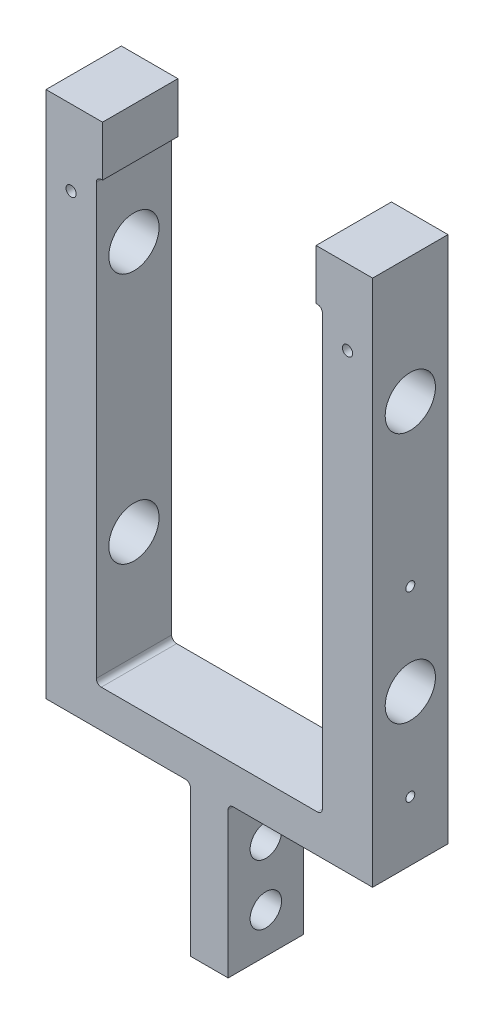
ISO-10303-21;
HEADER;
FILE_DESCRIPTION(('STEP AP214'),'2;1');
FILE_NAME('part.step','',(''),(''),'','','');
FILE_SCHEMA(('AUTOMOTIVE_DESIGN { 1 0 10303 214 1 1 1 1 }'));
ENDSEC;
DATA;
#1=APPLICATION_CONTEXT('core data for automotive mechanical design processes');
#2=APPLICATION_PROTOCOL_DEFINITION('international standard','automotive_design',2000,#1);
#3=PRODUCT_CONTEXT('',#1,'mechanical');
#4=PRODUCT('Part','Part','',(#3));
#5=PRODUCT_RELATED_PRODUCT_CATEGORY('part','',(#4));
#6=PRODUCT_DEFINITION_FORMATION('','',#4);
#7=PRODUCT_DEFINITION_CONTEXT('part definition',#1,'design');
#8=PRODUCT_DEFINITION('design','',#6,#7);
#9=PRODUCT_DEFINITION_SHAPE('','',#8);
#10=(LENGTH_UNIT() NAMED_UNIT(*) SI_UNIT(.MILLI.,.METRE.));
#11=(NAMED_UNIT(*) PLANE_ANGLE_UNIT() SI_UNIT($,.RADIAN.));
#12=(NAMED_UNIT(*) SI_UNIT($,.STERADIAN.) SOLID_ANGLE_UNIT());
#13=UNCERTAINTY_MEASURE_WITH_UNIT(LENGTH_MEASURE(1.E-05),#10,'distance_accuracy_value','');
#14=(GEOMETRIC_REPRESENTATION_CONTEXT(3) GLOBAL_UNCERTAINTY_ASSIGNED_CONTEXT((#13)) GLOBAL_UNIT_ASSIGNED_CONTEXT((#10,
#11,#12)) REPRESENTATION_CONTEXT('',''));
#15=CARTESIAN_POINT('',(0.,0.,0.));
#16=DIRECTION('',(0.,0.,1.));
#17=DIRECTION('',(1.,0.,0.));
#18=AXIS2_PLACEMENT_3D('',#15,#16,#17);
#19=CARTESIAN_POINT('',(41.275,152.4,9.52500000000001));
#20=DIRECTION('',(0.,-1.,0.));
#21=DIRECTION('',(0.,0.,-1.));
#22=AXIS2_PLACEMENT_3D('',#19,#20,#21);
#23=PLANE('',#22);
#24=DIRECTION('',(-1.,0.,0.));
#25=VECTOR('',#24,1.);
#26=CARTESIAN_POINT('',(41.275,152.4,-9.52500000000001));
#27=LINE('',#26,#25);
#28=CARTESIAN_POINT('',(41.275,152.4,-9.52500000000001));
#29=VERTEX_POINT('',#28);
#30=CARTESIAN_POINT('',(26.9875,152.4,-9.52500000000001));
#31=VERTEX_POINT('',#30);
#32=EDGE_CURVE('E272',#29,#31,#27,.T.);
#33=ORIENTED_EDGE('',*,*,#32,.T.);
#34=DIRECTION('',(0.,0.,1.));
#35=VECTOR('',#34,1.);
#36=CARTESIAN_POINT('',(26.9875,152.4,-9.52500000000001));
#37=LINE('',#36,#35);
#38=CARTESIAN_POINT('',(26.9875,152.4,9.52500000000001));
#39=VERTEX_POINT('',#38);
#40=EDGE_CURVE('E256',#31,#39,#37,.T.);
#41=ORIENTED_EDGE('',*,*,#40,.T.);
#42=DIRECTION('',(-1.,0.,0.));
#43=VECTOR('',#42,1.);
#44=CARTESIAN_POINT('',(41.275,152.4,9.52500000000001));
#45=LINE('',#44,#43);
#46=CARTESIAN_POINT('',(41.275,152.4,9.52500000000001));
#47=VERTEX_POINT('',#46);
#48=EDGE_CURVE('E464',#47,#39,#45,.T.);
#49=ORIENTED_EDGE('',*,*,#48,.F.);
#50=DIRECTION('',(0.,0.,-1.));
#51=VECTOR('',#50,1.);
#52=CARTESIAN_POINT('',(41.275,152.4,9.52500000000001));
#53=LINE('',#52,#51);
#54=EDGE_CURVE('E278',#47,#29,#53,.T.);
#55=ORIENTED_EDGE('',*,*,#54,.T.);
#56=EDGE_LOOP('',(#33,#41,#49,#55));
#57=FACE_BOUND('',#56,.T.);
#58=ADVANCED_FACE('F96',(#57),#23,.F.);
#59=CARTESIAN_POINT('',(28.575,139.7,9.52500000000001));
#60=DIRECTION('',(0.,-1.,0.));
#61=DIRECTION('',(0.,0.,-1.));
#62=AXIS2_PLACEMENT_3D('',#59,#60,#61);
#63=PLANE('',#62);
#64=DIRECTION('',(0.,0.,1.));
#65=VECTOR('',#64,1.);
#66=CARTESIAN_POINT('',(26.9875,139.7,-9.52500000000001));
#67=LINE('',#66,#65);
#68=CARTESIAN_POINT('',(26.9875,139.7,-9.52500000000001));
#69=VERTEX_POINT('',#68);
#70=CARTESIAN_POINT('',(26.9875,139.7,9.52500000000001));
#71=VERTEX_POINT('',#70);
#72=EDGE_CURVE('E510',#69,#71,#67,.T.);
#73=ORIENTED_EDGE('',*,*,#72,.F.);
#74=DIRECTION('',(-1.,0.,0.));
#75=VECTOR('',#74,1.);
#76=CARTESIAN_POINT('',(28.575,139.7,-9.52500000000001));
#77=LINE('',#76,#75);
#78=CARTESIAN_POINT('',(27.305,139.7,-9.52500000000001));
#79=VERTEX_POINT('',#78);
#80=EDGE_CURVE('E274',#79,#69,#77,.T.);
#81=ORIENTED_EDGE('',*,*,#80,.F.);
#82=DIRECTION('',(0.,0.,-1.));
#83=VECTOR('',#82,1.);
#84=CARTESIAN_POINT('',(27.305,139.7,9.52500000000001));
#85=LINE('',#84,#83);
#86=CARTESIAN_POINT('',(27.305,139.7,9.52500000000001));
#87=VERTEX_POINT('',#86);
#88=EDGE_CURVE('E371',#79,#87,#85,.F.);
#89=ORIENTED_EDGE('',*,*,#88,.T.);
#90=DIRECTION('',(-1.,0.,0.));
#91=VECTOR('',#90,1.);
#92=CARTESIAN_POINT('',(28.575,139.7,9.52500000000001));
#93=LINE('',#92,#91);
#94=EDGE_CURVE('E433',#87,#71,#93,.T.);
#95=ORIENTED_EDGE('',*,*,#94,.T.);
#96=EDGE_LOOP('',(#73,#81,#89,#95));
#97=FACE_BOUND('',#96,.T.);
#98=ADVANCED_FACE('F509',(#97),#63,.T.);
#99=CARTESIAN_POINT('',(41.275,131.596658993696,9.52500000000001));
#100=DIRECTION('',(-1.,0.,0.));
#101=DIRECTION('',(0.,-1.,0.));
#102=AXIS2_PLACEMENT_3D('',#99,#100,#101);
#103=PLANE('',#102);
#104=CARTESIAN_POINT('',(41.275,80.1624,0.));
#105=DIRECTION('',(1.,0.,0.));
#106=DIRECTION('',(0.,0.,-1.));
#107=AXIS2_PLACEMENT_3D('',#104,#105,#106);
#108=CIRCLE('',#107,1.13029999999999);
#109=CARTESIAN_POINT('',(41.275,80.1624,-1.1303));
#110=VERTEX_POINT('',#109);
#111=EDGE_CURVE('E657',#110,#110,#108,.T.);
#112=ORIENTED_EDGE('',*,*,#111,.F.);
#113=EDGE_LOOP('',(#112));
#114=FACE_BOUND('',#113,.T.);
#115=CARTESIAN_POINT('',(41.275,57.15,0.));
#116=DIRECTION('',(-1.,0.,0.));
#117=DIRECTION('',(0.,-1.,0.));
#118=AXIS2_PLACEMENT_3D('',#115,#116,#117);
#119=CIRCLE('',#118,6.34999999999673);
#120=CARTESIAN_POINT('',(41.275,50.8000000000033,0.));
#121=VERTEX_POINT('',#120);
#122=EDGE_CURVE('E321',#121,#121,#119,.T.);
#123=ORIENTED_EDGE('',*,*,#122,.T.);
#124=EDGE_LOOP('',(#123));
#125=FACE_BOUND('',#124,.T.);
#126=CARTESIAN_POINT('',(41.275,120.65,0.));
#127=DIRECTION('',(-1.,0.,0.));
#128=DIRECTION('',(0.,-1.,0.));
#129=AXIS2_PLACEMENT_3D('',#126,#127,#128);
#130=CIRCLE('',#129,6.34999999999999);
#131=CARTESIAN_POINT('',(41.275,114.3,0.));
#132=VERTEX_POINT('',#131);
#133=EDGE_CURVE('E608',#132,#132,#130,.T.);
#134=ORIENTED_EDGE('',*,*,#133,.T.);
#135=EDGE_LOOP('',(#134));
#136=FACE_BOUND('',#135,.T.);
#137=DIRECTION('',(0.,1.,0.));
#138=VECTOR('',#137,1.);
#139=CARTESIAN_POINT('',(41.275,131.596658993696,-9.52500000000001));
#140=LINE('',#139,#138);
#141=CARTESIAN_POINT('',(41.275,19.05,-9.52500000000001));
#142=VERTEX_POINT('',#141);
#143=EDGE_CURVE('E289',#142,#29,#140,.T.);
#144=ORIENTED_EDGE('',*,*,#143,.T.);
#145=ORIENTED_EDGE('',*,*,#54,.F.);
#146=DIRECTION('',(0.,1.,0.));
#147=VECTOR('',#146,1.);
#148=CARTESIAN_POINT('',(41.275,19.05,9.52500000000001));
#149=LINE('',#148,#147);
#150=CARTESIAN_POINT('',(41.275,19.05,9.52500000000001));
#151=VERTEX_POINT('',#150);
#152=EDGE_CURVE('E460',#151,#47,#149,.T.);
#153=ORIENTED_EDGE('',*,*,#152,.F.);
#154=DIRECTION('',(0.,0.,-1.));
#155=VECTOR('',#154,1.);
#156=CARTESIAN_POINT('',(41.275,19.05,9.52500000000001));
#157=LINE('',#156,#155);
#158=EDGE_CURVE('E311',#151,#142,#157,.T.);
#159=ORIENTED_EDGE('',*,*,#158,.T.);
#160=EDGE_LOOP('',(#144,#145,#153,#159));
#161=FACE_BOUND('',#160,.T.);
#162=CARTESIAN_POINT('',(41.275,34.1376,0.));
#163=DIRECTION('',(1.,0.,0.));
#164=DIRECTION('',(0.,0.,-1.));
#165=AXIS2_PLACEMENT_3D('',#162,#163,#164);
#166=CIRCLE('',#165,1.13029999999999);
#167=CARTESIAN_POINT('',(41.275,34.1376,-1.13029999999999));
#168=VERTEX_POINT('',#167);
#169=EDGE_CURVE('E649',#168,#168,#166,.T.);
#170=ORIENTED_EDGE('',*,*,#169,.F.);
#171=EDGE_LOOP('',(#170));
#172=FACE_BOUND('',#171,.T.);
#173=ADVANCED_FACE('F479',(#114,#125,#136,#161,#172),#103,.F.);
#174=CARTESIAN_POINT('',(28.575,139.7,9.52500000000001));
#175=DIRECTION('',(-1.,0.,0.));
#176=DIRECTION('',(0.,-1.,0.));
#177=AXIS2_PLACEMENT_3D('',#174,#175,#176);
#178=PLANE('',#177);
#179=CARTESIAN_POINT('',(28.575,80.1624,0.));
#180=DIRECTION('',(-1.,0.,0.));
#181=DIRECTION('',(0.,-1.,0.));
#182=AXIS2_PLACEMENT_3D('',#179,#180,#181);
#183=CIRCLE('',#182,1.13029999999999);
#184=CARTESIAN_POINT('',(28.575,79.0321,0.));
#185=VERTEX_POINT('',#184);
#186=EDGE_CURVE('E653',#185,#185,#183,.F.);
#187=ORIENTED_EDGE('',*,*,#186,.T.);
#188=EDGE_LOOP('',(#187));
#189=FACE_BOUND('',#188,.T.);
#190=DIRECTION('',(0.,1.,0.));
#191=VECTOR('',#190,1.);
#192=CARTESIAN_POINT('',(28.575,139.7,-9.52500000000001));
#193=LINE('',#192,#191);
#194=CARTESIAN_POINT('',(28.575,29.845,-9.52500000000001));
#195=VERTEX_POINT('',#194);
#196=CARTESIAN_POINT('',(28.575,138.43,-9.52500000000001));
#197=VERTEX_POINT('',#196);
#198=EDGE_CURVE('E454',#195,#197,#193,.T.);
#199=ORIENTED_EDGE('',*,*,#198,.F.);
#200=DIRECTION('',(0.,0.,-1.));
#201=VECTOR('',#200,1.);
#202=CARTESIAN_POINT('',(28.575,29.845,9.52500000000001));
#203=LINE('',#202,#201);
#204=CARTESIAN_POINT('',(28.575,29.845,9.52500000000001));
#205=VERTEX_POINT('',#204);
#206=EDGE_CURVE('E364',#195,#205,#203,.F.);
#207=ORIENTED_EDGE('',*,*,#206,.T.);
#208=DIRECTION('',(0.,1.,0.));
#209=VECTOR('',#208,1.);
#210=CARTESIAN_POINT('',(28.575,139.7,9.52500000000001));
#211=LINE('',#210,#209);
#212=CARTESIAN_POINT('',(28.575,138.43,9.52500000000001));
#213=VERTEX_POINT('',#212);
#214=EDGE_CURVE('E439',#205,#213,#211,.T.);
#215=ORIENTED_EDGE('',*,*,#214,.T.);
#216=DIRECTION('',(0.,0.,-1.));
#217=VECTOR('',#216,1.);
#218=CARTESIAN_POINT('',(28.575,138.43,-9.52500000000001));
#219=LINE('',#218,#217);
#220=EDGE_CURVE('E360',#213,#197,#219,.T.);
#221=ORIENTED_EDGE('',*,*,#220,.T.);
#222=EDGE_LOOP('',(#199,#207,#215,#221));
#223=FACE_BOUND('',#222,.T.);
#224=CARTESIAN_POINT('',(28.575,120.65,0.));
#225=DIRECTION('',(-1.,0.,0.));
#226=DIRECTION('',(0.,-1.,0.));
#227=AXIS2_PLACEMENT_3D('',#224,#225,#226);
#228=CIRCLE('',#227,6.34999999999999);
#229=CARTESIAN_POINT('',(28.575,114.3,0.));
#230=VERTEX_POINT('',#229);
#231=EDGE_CURVE('E316',#230,#230,#228,.T.);
#232=ORIENTED_EDGE('',*,*,#231,.F.);
#233=EDGE_LOOP('',(#232));
#234=FACE_BOUND('',#233,.T.);
#235=CARTESIAN_POINT('',(28.575,57.15,0.));
#236=DIRECTION('',(-1.,0.,0.));
#237=DIRECTION('',(0.,-1.,0.));
#238=AXIS2_PLACEMENT_3D('',#235,#236,#237);
#239=CIRCLE('',#238,6.34999999999673);
#240=CARTESIAN_POINT('',(28.575,50.8000000000033,0.));
#241=VERTEX_POINT('',#240);
#242=EDGE_CURVE('E322',#241,#241,#239,.T.);
#243=ORIENTED_EDGE('',*,*,#242,.F.);
#244=EDGE_LOOP('',(#243));
#245=FACE_BOUND('',#244,.T.);
#246=CARTESIAN_POINT('',(28.575,34.1376,0.));
#247=DIRECTION('',(-1.,0.,0.));
#248=DIRECTION('',(0.,-1.,0.));
#249=AXIS2_PLACEMENT_3D('',#246,#247,#248);
#250=CIRCLE('',#249,1.13029999999999);
#251=CARTESIAN_POINT('',(28.575,33.0073,0.));
#252=VERTEX_POINT('',#251);
#253=EDGE_CURVE('E497',#252,#252,#250,.F.);
#254=ORIENTED_EDGE('',*,*,#253,.T.);
#255=EDGE_LOOP('',(#254));
#256=FACE_BOUND('',#255,.T.);
#257=ADVANCED_FACE('F519',(#189,#223,#234,#245,#256),#178,.T.);
#258=CARTESIAN_POINT('',(0.,0.,9.52500000000001));
#259=DIRECTION('',(0.,0.,1.));
#260=DIRECTION('',(1.,0.,0.));
#261=AXIS2_PLACEMENT_3D('',#258,#259,#260);
#262=PLANE('',#261);
#263=CARTESIAN_POINT('',(-34.925,133.35,9.52500000000001));
#264=DIRECTION('',(0.,0.,1.));
#265=DIRECTION('',(1.,0.,0.));
#266=AXIS2_PLACEMENT_3D('',#263,#264,#265);
#267=CIRCLE('',#266,1.28904999999999);
#268=CARTESIAN_POINT('',(-33.63595,133.35,9.52500000000001));
#269=VERTEX_POINT('',#268);
#270=EDGE_CURVE('E698',#269,#269,#267,.T.);
#271=ORIENTED_EDGE('',*,*,#270,.F.);
#272=EDGE_LOOP('',(#271));
#273=FACE_BOUND('',#272,.T.);
#274=CARTESIAN_POINT('',(34.925,133.35,9.52500000000001));
#275=DIRECTION('',(0.,0.,1.));
#276=DIRECTION('',(1.,0.,0.));
#277=AXIS2_PLACEMENT_3D('',#274,#275,#276);
#278=CIRCLE('',#277,1.28904999999999);
#279=CARTESIAN_POINT('',(36.21405,133.35,9.52500000000001));
#280=VERTEX_POINT('',#279);
#281=EDGE_CURVE('E692',#280,#280,#278,.T.);
#282=ORIENTED_EDGE('',*,*,#281,.F.);
#283=EDGE_LOOP('',(#282));
#284=FACE_BOUND('',#283,.T.);
#285=DIRECTION('',(0.,1.,0.));
#286=VECTOR('',#285,1.);
#287=CARTESIAN_POINT('',(26.9875,152.4,9.52500000000001));
#288=LINE('',#287,#286);
#289=EDGE_CURVE('E259',#71,#39,#288,.T.);
#290=ORIENTED_EDGE('',*,*,#289,.F.);
#291=ORIENTED_EDGE('',*,*,#94,.F.);
#292=CARTESIAN_POINT('',(27.305,138.43,9.52500000000001));
#293=DIRECTION('',(0.,0.,1.));
#294=DIRECTION('',(1.,0.,0.));
#295=AXIS2_PLACEMENT_3D('',#292,#293,#294);
#296=CIRCLE('',#295,1.27);
#297=EDGE_CURVE('E401',#87,#213,#296,.F.);
#298=ORIENTED_EDGE('',*,*,#297,.T.);
#299=ORIENTED_EDGE('',*,*,#214,.F.);
#300=CARTESIAN_POINT('',(27.305,29.845,9.52500000000001));
#301=DIRECTION('',(0.,0.,1.));
#302=DIRECTION('',(1.,0.,0.));
#303=AXIS2_PLACEMENT_3D('',#300,#301,#302);
#304=CIRCLE('',#303,1.27);
#305=CARTESIAN_POINT('',(27.305,28.575,9.52500000000001));
#306=VERTEX_POINT('',#305);
#307=EDGE_CURVE('E395',#205,#306,#304,.F.);
#308=ORIENTED_EDGE('',*,*,#307,.T.);
#309=DIRECTION('',(1.,0.,0.));
#310=VECTOR('',#309,1.);
#311=CARTESIAN_POINT('',(-28.575,28.575,9.52500000000001));
#312=LINE('',#311,#310);
#313=CARTESIAN_POINT('',(-27.305,28.575,9.52500000000001));
#314=VERTEX_POINT('',#313);
#315=EDGE_CURVE('E432',#314,#306,#312,.T.);
#316=ORIENTED_EDGE('',*,*,#315,.F.);
#317=CARTESIAN_POINT('',(-27.305,29.845,9.52500000000001));
#318=DIRECTION('',(0.,0.,1.));
#319=DIRECTION('',(1.,0.,0.));
#320=AXIS2_PLACEMENT_3D('',#317,#318,#319);
#321=CIRCLE('',#320,1.27);
#322=CARTESIAN_POINT('',(-28.575,29.845,9.52500000000001));
#323=VERTEX_POINT('',#322);
#324=EDGE_CURVE('E389',#314,#323,#321,.F.);
#325=ORIENTED_EDGE('',*,*,#324,.T.);
#326=DIRECTION('',(0.,-1.,0.));
#327=VECTOR('',#326,1.);
#328=CARTESIAN_POINT('',(-28.575,139.7,9.52500000000001));
#329=LINE('',#328,#327);
#330=CARTESIAN_POINT('',(-28.575,138.43,9.52500000000001));
#331=VERTEX_POINT('',#330);
#332=EDGE_CURVE('E428',#331,#323,#329,.T.);
#333=ORIENTED_EDGE('',*,*,#332,.F.);
#334=CARTESIAN_POINT('',(-27.305,138.43,9.52500000000001));
#335=DIRECTION('',(0.,0.,1.));
#336=DIRECTION('',(1.,0.,0.));
#337=AXIS2_PLACEMENT_3D('',#334,#335,#336);
#338=CIRCLE('',#337,1.27);
#339=CARTESIAN_POINT('',(-27.305,139.7,9.52500000000001));
#340=VERTEX_POINT('',#339);
#341=EDGE_CURVE('E12',#331,#340,#338,.F.);
#342=ORIENTED_EDGE('',*,*,#341,.T.);
#343=CARTESIAN_POINT('',(-26.9875,139.7,9.52500000000001));
#344=VERTEX_POINT('',#343);
#345=EDGE_CURVE('E427',#344,#340,#93,.T.);
#346=ORIENTED_EDGE('',*,*,#345,.F.);
#347=DIRECTION('',(0.,-1.,0.));
#348=VECTOR('',#347,1.);
#349=CARTESIAN_POINT('',(-26.9875,152.4,9.52500000000001));
#350=LINE('',#349,#348);
#351=CARTESIAN_POINT('',(-26.9875,152.4,9.52500000000001));
#352=VERTEX_POINT('',#351);
#353=EDGE_CURVE('E112',#352,#344,#350,.T.);
#354=ORIENTED_EDGE('',*,*,#353,.F.);
#355=CARTESIAN_POINT('',(-41.275,152.4,9.52500000000001));
#356=VERTEX_POINT('',#355);
#357=EDGE_CURVE('E463',#352,#356,#45,.T.);
#358=ORIENTED_EDGE('',*,*,#357,.T.);
#359=DIRECTION('',(0.,-1.,0.));
#360=VECTOR('',#359,1.);
#361=CARTESIAN_POINT('',(-41.275,152.4,9.52500000000001));
#362=LINE('',#361,#360);
#363=CARTESIAN_POINT('',(-41.275,19.05,9.52500000000001));
#364=VERTEX_POINT('',#363);
#365=EDGE_CURVE('E467',#356,#364,#362,.T.);
#366=ORIENTED_EDGE('',*,*,#365,.T.);
#367=DIRECTION('',(1.,0.,0.));
#368=VECTOR('',#367,1.);
#369=CARTESIAN_POINT('',(-9.525,19.05,9.52500000000001));
#370=LINE('',#369,#368);
#371=CARTESIAN_POINT('',(-9.525,19.05,9.52500000000001));
#372=VERTEX_POINT('',#371);
#373=EDGE_CURVE('E301',#364,#372,#370,.T.);
#374=ORIENTED_EDGE('',*,*,#373,.T.);
#375=DIRECTION('',(0.,1.,0.));
#376=VECTOR('',#375,1.);
#377=CARTESIAN_POINT('',(-9.525,19.0579297952041,9.52500000000001));
#378=LINE('',#377,#376);
#379=CARTESIAN_POINT('',(-9.525,19.0579297952041,9.52500000000001));
#380=VERTEX_POINT('',#379);
#381=EDGE_CURVE('E630',#372,#380,#378,.T.);
#382=ORIENTED_EDGE('',*,*,#381,.T.);
#383=DIRECTION('',(1.,0.,0.));
#384=VECTOR('',#383,1.);
#385=CARTESIAN_POINT('',(-4.7625,19.0579297952041,9.52500000000001));
#386=LINE('',#385,#384);
#387=CARTESIAN_POINT('',(-6.0325,19.0579297952041,9.52500000000001));
#388=VERTEX_POINT('',#387);
#389=EDGE_CURVE('E639',#380,#388,#386,.T.);
#390=ORIENTED_EDGE('',*,*,#389,.T.);
#391=CARTESIAN_POINT('',(-6.0325,17.7879297952041,9.52500000000001));
#392=DIRECTION('',(0.,0.,1.));
#393=DIRECTION('',(1.,0.,0.));
#394=AXIS2_PLACEMENT_3D('',#391,#392,#393);
#395=CIRCLE('',#394,1.27);
#396=CARTESIAN_POINT('',(-4.7625,17.7879297952041,9.52500000000001));
#397=VERTEX_POINT('',#396);
#398=EDGE_CURVE('E383',#388,#397,#395,.F.);
#399=ORIENTED_EDGE('',*,*,#398,.T.);
#400=DIRECTION('',(0.,-1.,0.));
#401=VECTOR('',#400,1.);
#402=CARTESIAN_POINT('',(-4.7625,19.0579297952041,9.52500000000001));
#403=LINE('',#402,#401);
#404=CARTESIAN_POINT('',(-4.7625,-19.05,9.52500000000001));
#405=VERTEX_POINT('',#404);
#406=EDGE_CURVE('E626',#397,#405,#403,.T.);
#407=ORIENTED_EDGE('',*,*,#406,.T.);
#408=DIRECTION('',(-1.,0.,0.));
#409=VECTOR('',#408,1.);
#410=CARTESIAN_POINT('',(4.7625,-19.05,9.52500000000001));
#411=LINE('',#410,#409);
#412=CARTESIAN_POINT('',(4.7625,-19.05,9.52500000000001));
#413=VERTEX_POINT('',#412);
#414=EDGE_CURVE('E668',#413,#405,#411,.T.);
#415=ORIENTED_EDGE('',*,*,#414,.F.);
#416=DIRECTION('',(0.,1.,0.));
#417=VECTOR('',#416,1.);
#418=CARTESIAN_POINT('',(4.7625,19.05,9.52500000000001));
#419=LINE('',#418,#417);
#420=CARTESIAN_POINT('',(4.7625,17.78,9.52500000000001));
#421=VERTEX_POINT('',#420);
#422=EDGE_CURVE('E496',#413,#421,#419,.T.);
#423=ORIENTED_EDGE('',*,*,#422,.T.);
#424=CARTESIAN_POINT('',(6.0325,17.78,9.52500000000001));
#425=DIRECTION('',(0.,0.,1.));
#426=DIRECTION('',(1.,0.,0.));
#427=AXIS2_PLACEMENT_3D('',#424,#425,#426);
#428=CIRCLE('',#427,1.27);
#429=CARTESIAN_POINT('',(6.0325,19.05,9.52500000000001));
#430=VERTEX_POINT('',#429);
#431=EDGE_CURVE('E377',#421,#430,#428,.F.);
#432=ORIENTED_EDGE('',*,*,#431,.T.);
#433=DIRECTION('',(1.,0.,0.));
#434=VECTOR('',#433,1.);
#435=CARTESIAN_POINT('',(9.525,19.05,9.52500000000001));
#436=LINE('',#435,#434);
#437=EDGE_CURVE('E296',#430,#151,#436,.T.);
#438=ORIENTED_EDGE('',*,*,#437,.T.);
#439=ORIENTED_EDGE('',*,*,#152,.T.);
#440=ORIENTED_EDGE('',*,*,#48,.T.);
#441=EDGE_LOOP('',(#290,#291,#298,#299,#308,#316,#325,#333,#342,#346,#354,#358,#366,#374,#382,
#390,#399,#407,#415,#423,#432,#438,#439,#440));
#442=FACE_BOUND('',#441,.T.);
#443=ADVANCED_FACE('F426',(#273,#284,#442),#262,.T.);
#444=CARTESIAN_POINT('',(0.,0.,-9.52500000000001));
#445=DIRECTION('',(0.,0.,1.));
#446=DIRECTION('',(1.,0.,0.));
#447=AXIS2_PLACEMENT_3D('',#444,#445,#446);
#448=PLANE('',#447);
#449=CARTESIAN_POINT('',(-34.925,133.35,-9.52499999999999));
#450=DIRECTION('',(0.,0.,1.));
#451=DIRECTION('',(1.,0.,0.));
#452=AXIS2_PLACEMENT_3D('',#449,#450,#451);
#453=CIRCLE('',#452,1.28904999999999);
#454=CARTESIAN_POINT('',(-33.63595,133.35,-9.52499999999999));
#455=VERTEX_POINT('',#454);
#456=EDGE_CURVE('E695',#455,#455,#453,.T.);
#457=ORIENTED_EDGE('',*,*,#456,.T.);
#458=EDGE_LOOP('',(#457));
#459=FACE_BOUND('',#458,.T.);
#460=CARTESIAN_POINT('',(34.925,133.35,-9.52499999999999));
#461=DIRECTION('',(0.,0.,1.));
#462=DIRECTION('',(1.,0.,0.));
#463=AXIS2_PLACEMENT_3D('',#460,#461,#462);
#464=CIRCLE('',#463,1.28904999999999);
#465=CARTESIAN_POINT('',(36.21405,133.35,-9.52499999999999));
#466=VERTEX_POINT('',#465);
#467=EDGE_CURVE('E506',#466,#466,#464,.T.);
#468=ORIENTED_EDGE('',*,*,#467,.T.);
#469=EDGE_LOOP('',(#468));
#470=FACE_BOUND('',#469,.T.);
#471=ORIENTED_EDGE('',*,*,#80,.T.);
#472=DIRECTION('',(0.,1.,0.));
#473=VECTOR('',#472,1.);
#474=CARTESIAN_POINT('',(26.9875,152.4,-9.52500000000001));
#475=LINE('',#474,#473);
#476=EDGE_CURVE('E120',#69,#31,#475,.T.);
#477=ORIENTED_EDGE('',*,*,#476,.T.);
#478=ORIENTED_EDGE('',*,*,#32,.F.);
#479=ORIENTED_EDGE('',*,*,#143,.F.);
#480=DIRECTION('',(1.,0.,0.));
#481=VECTOR('',#480,1.);
#482=CARTESIAN_POINT('',(9.525,19.05,-9.52500000000001));
#483=LINE('',#482,#481);
#484=CARTESIAN_POINT('',(6.0325,19.05,-9.52500000000001));
#485=VERTEX_POINT('',#484);
#486=EDGE_CURVE('E448',#485,#142,#483,.T.);
#487=ORIENTED_EDGE('',*,*,#486,.F.);
#488=CARTESIAN_POINT('',(6.0325,17.78,-9.52500000000001));
#489=DIRECTION('',(0.,0.,1.));
#490=DIRECTION('',(1.,0.,0.));
#491=AXIS2_PLACEMENT_3D('',#488,#489,#490);
#492=CIRCLE('',#491,1.27);
#493=CARTESIAN_POINT('',(4.7625,17.78,-9.52500000000001));
#494=VERTEX_POINT('',#493);
#495=EDGE_CURVE('E374',#485,#494,#492,.T.);
#496=ORIENTED_EDGE('',*,*,#495,.T.);
#497=DIRECTION('',(0.,1.,0.));
#498=VECTOR('',#497,1.);
#499=CARTESIAN_POINT('',(4.7625,19.05,-9.52500000000001));
#500=LINE('',#499,#498);
#501=CARTESIAN_POINT('',(4.7625,-19.05,-9.52500000000001));
#502=VERTEX_POINT('',#501);
#503=EDGE_CURVE('E484',#502,#494,#500,.T.);
#504=ORIENTED_EDGE('',*,*,#503,.F.);
#505=DIRECTION('',(1.,0.,0.));
#506=VECTOR('',#505,1.);
#507=CARTESIAN_POINT('',(4.7625,-19.05,-9.52500000000001));
#508=LINE('',#507,#506);
#509=CARTESIAN_POINT('',(-4.7625,-19.05,-9.52500000000001));
#510=VERTEX_POINT('',#509);
#511=EDGE_CURVE('E661',#510,#502,#508,.T.);
#512=ORIENTED_EDGE('',*,*,#511,.F.);
#513=DIRECTION('',(0.,-1.,0.));
#514=VECTOR('',#513,1.);
#515=CARTESIAN_POINT('',(-4.7625,19.0579297952041,-9.52500000000001));
#516=LINE('',#515,#514);
#517=CARTESIAN_POINT('',(-4.7625,17.7879297952041,-9.52500000000001));
#518=VERTEX_POINT('',#517);
#519=EDGE_CURVE('E627',#518,#510,#516,.T.);
#520=ORIENTED_EDGE('',*,*,#519,.F.);
#521=CARTESIAN_POINT('',(-6.0325,17.7879297952041,-9.52500000000001));
#522=DIRECTION('',(0.,0.,1.));
#523=DIRECTION('',(1.,0.,0.));
#524=AXIS2_PLACEMENT_3D('',#521,#522,#523);
#525=CIRCLE('',#524,1.27);
#526=CARTESIAN_POINT('',(-6.0325,19.0579297952041,-9.52500000000001));
#527=VERTEX_POINT('',#526);
#528=EDGE_CURVE('E380',#518,#527,#525,.T.);
#529=ORIENTED_EDGE('',*,*,#528,.T.);
#530=DIRECTION('',(1.,0.,0.));
#531=VECTOR('',#530,1.);
#532=CARTESIAN_POINT('',(-4.7625,19.0579297952041,-9.52500000000001));
#533=LINE('',#532,#531);
#534=CARTESIAN_POINT('',(-9.525,19.0579297952041,-9.52500000000001));
#535=VERTEX_POINT('',#534);
#536=EDGE_CURVE('E631',#535,#527,#533,.T.);
#537=ORIENTED_EDGE('',*,*,#536,.F.);
#538=DIRECTION('',(0.,1.,0.));
#539=VECTOR('',#538,1.);
#540=CARTESIAN_POINT('',(-9.525,19.0579297952041,-9.52500000000001));
#541=LINE('',#540,#539);
#542=CARTESIAN_POINT('',(-9.525,19.05,-9.52500000000001));
#543=VERTEX_POINT('',#542);
#544=EDGE_CURVE('E622',#543,#535,#541,.T.);
#545=ORIENTED_EDGE('',*,*,#544,.F.);
#546=DIRECTION('',(1.,0.,0.));
#547=VECTOR('',#546,1.);
#548=CARTESIAN_POINT('',(-9.525,19.05,-9.52500000000001));
#549=LINE('',#548,#547);
#550=CARTESIAN_POINT('',(-41.275,19.05,-9.52500000000001));
#551=VERTEX_POINT('',#550);
#552=EDGE_CURVE('E286',#551,#543,#549,.T.);
#553=ORIENTED_EDGE('',*,*,#552,.F.);
#554=DIRECTION('',(0.,-1.,0.));
#555=VECTOR('',#554,1.);
#556=CARTESIAN_POINT('',(-41.275,19.05,-9.52500000000001));
#557=LINE('',#556,#555);
#558=CARTESIAN_POINT('',(-41.275,152.4,-9.52500000000001));
#559=VERTEX_POINT('',#558);
#560=EDGE_CURVE('E280',#559,#551,#557,.T.);
#561=ORIENTED_EDGE('',*,*,#560,.F.);
#562=CARTESIAN_POINT('',(-26.9875,152.4,-9.52500000000001));
#563=VERTEX_POINT('',#562);
#564=EDGE_CURVE('E281',#563,#559,#27,.T.);
#565=ORIENTED_EDGE('',*,*,#564,.F.);
#566=DIRECTION('',(0.,-1.,0.));
#567=VECTOR('',#566,1.);
#568=CARTESIAN_POINT('',(-26.9875,152.4,-9.52500000000001));
#569=LINE('',#568,#567);
#570=CARTESIAN_POINT('',(-26.9875,139.7,-9.52500000000001));
#571=VERTEX_POINT('',#570);
#572=EDGE_CURVE('E265',#563,#571,#569,.T.);
#573=ORIENTED_EDGE('',*,*,#572,.T.);
#574=CARTESIAN_POINT('',(-27.305,139.7,-9.52500000000001));
#575=VERTEX_POINT('',#574);
#576=EDGE_CURVE('E411',#571,#575,#77,.T.);
#577=ORIENTED_EDGE('',*,*,#576,.T.);
#578=CARTESIAN_POINT('',(-27.305,138.43,-9.52500000000001));
#579=DIRECTION('',(0.,0.,1.));
#580=DIRECTION('',(1.,0.,0.));
#581=AXIS2_PLACEMENT_3D('',#578,#579,#580);
#582=CIRCLE('',#581,1.27);
#583=CARTESIAN_POINT('',(-28.575,138.43,-9.52500000000001));
#584=VERTEX_POINT('',#583);
#585=EDGE_CURVE('E105',#575,#584,#582,.T.);
#586=ORIENTED_EDGE('',*,*,#585,.T.);
#587=DIRECTION('',(0.,-1.,0.));
#588=VECTOR('',#587,1.);
#589=CARTESIAN_POINT('',(-28.575,139.7,-9.52500000000001));
#590=LINE('',#589,#588);
#591=CARTESIAN_POINT('',(-28.575,29.845,-9.52500000000001));
#592=VERTEX_POINT('',#591);
#593=EDGE_CURVE('E408',#584,#592,#590,.T.);
#594=ORIENTED_EDGE('',*,*,#593,.T.);
#595=CARTESIAN_POINT('',(-27.305,29.845,-9.52500000000001));
#596=DIRECTION('',(0.,0.,1.));
#597=DIRECTION('',(1.,0.,0.));
#598=AXIS2_PLACEMENT_3D('',#595,#596,#597);
#599=CIRCLE('',#598,1.27);
#600=CARTESIAN_POINT('',(-27.305,28.575,-9.52500000000001));
#601=VERTEX_POINT('',#600);
#602=EDGE_CURVE('E386',#592,#601,#599,.T.);
#603=ORIENTED_EDGE('',*,*,#602,.T.);
#604=DIRECTION('',(1.,0.,0.));
#605=VECTOR('',#604,1.);
#606=CARTESIAN_POINT('',(-28.575,28.575,-9.52500000000001));
#607=LINE('',#606,#605);
#608=CARTESIAN_POINT('',(27.305,28.575,-9.52500000000001));
#609=VERTEX_POINT('',#608);
#610=EDGE_CURVE('E421',#601,#609,#607,.T.);
#611=ORIENTED_EDGE('',*,*,#610,.T.);
#612=CARTESIAN_POINT('',(27.305,29.845,-9.52500000000001));
#613=DIRECTION('',(0.,0.,1.));
#614=DIRECTION('',(1.,0.,0.));
#615=AXIS2_PLACEMENT_3D('',#612,#613,#614);
#616=CIRCLE('',#615,1.27);
#617=EDGE_CURVE('E392',#609,#195,#616,.T.);
#618=ORIENTED_EDGE('',*,*,#617,.T.);
#619=ORIENTED_EDGE('',*,*,#198,.T.);
#620=CARTESIAN_POINT('',(27.305,138.43,-9.52500000000001));
#621=DIRECTION('',(0.,0.,1.));
#622=DIRECTION('',(1.,0.,0.));
#623=AXIS2_PLACEMENT_3D('',#620,#621,#622);
#624=CIRCLE('',#623,1.27);
#625=EDGE_CURVE('E398',#197,#79,#624,.T.);
#626=ORIENTED_EDGE('',*,*,#625,.T.);
#627=EDGE_LOOP('',(#471,#477,#478,#479,#487,#496,#504,#512,#520,#529,#537,#545,#553,#561,#565,
#573,#577,#586,#594,#603,#611,#618,#619,#626));
#628=FACE_BOUND('',#627,.T.);
#629=ADVANCED_FACE('F270',(#459,#470,#628),#448,.F.);
#630=CARTESIAN_POINT('',(9.525,19.05,9.52500000000001));
#631=DIRECTION('',(0.,1.,0.));
#632=DIRECTION('',(-1.,0.,0.));
#633=AXIS2_PLACEMENT_3D('',#630,#631,#632);
#634=PLANE('',#633);
#635=ORIENTED_EDGE('',*,*,#437,.F.);
#636=DIRECTION('',(0.,0.,-1.));
#637=VECTOR('',#636,1.);
#638=CARTESIAN_POINT('',(6.0325,19.05,-9.52500000000001));
#639=LINE('',#638,#637);
#640=EDGE_CURVE('E315',#430,#485,#639,.T.);
#641=ORIENTED_EDGE('',*,*,#640,.T.);
#642=ORIENTED_EDGE('',*,*,#486,.T.);
#643=ORIENTED_EDGE('',*,*,#158,.F.);
#644=EDGE_LOOP('',(#635,#641,#642,#643));
#645=FACE_BOUND('',#644,.T.);
#646=ADVANCED_FACE('F503',(#645),#634,.F.);
#647=ORIENTED_EDGE('',*,*,#357,.F.);
#648=DIRECTION('',(0.,0.,1.));
#649=VECTOR('',#648,1.);
#650=CARTESIAN_POINT('',(-26.9875,152.4,-9.52500000000001));
#651=LINE('',#650,#649);
#652=EDGE_CURVE('E264',#563,#352,#651,.T.);
#653=ORIENTED_EDGE('',*,*,#652,.F.);
#654=ORIENTED_EDGE('',*,*,#564,.T.);
#655=DIRECTION('',(0.,0.,-1.));
#656=VECTOR('',#655,1.);
#657=CARTESIAN_POINT('',(-41.275,152.4,9.52500000000001));
#658=LINE('',#657,#656);
#659=EDGE_CURVE('E305',#356,#559,#658,.T.);
#660=ORIENTED_EDGE('',*,*,#659,.F.);
#661=EDGE_LOOP('',(#647,#653,#654,#660));
#662=FACE_BOUND('',#661,.T.);
#663=ADVANCED_FACE('F543',(#662),#23,.F.);
#664=CARTESIAN_POINT('',(-41.275,19.05,9.52500000000001));
#665=DIRECTION('',(1.,0.,0.));
#666=DIRECTION('',(0.,1.,0.));
#667=AXIS2_PLACEMENT_3D('',#664,#665,#666);
#668=PLANE('',#667);
#669=CARTESIAN_POINT('',(-41.275,57.15,0.));
#670=DIRECTION('',(-1.,0.,0.));
#671=DIRECTION('',(0.,-1.,0.));
#672=AXIS2_PLACEMENT_3D('',#669,#670,#671);
#673=CIRCLE('',#672,6.34999999999673);
#674=CARTESIAN_POINT('',(-41.275,50.8000000000033,0.));
#675=VERTEX_POINT('',#674);
#676=EDGE_CURVE('E613',#675,#675,#673,.T.);
#677=ORIENTED_EDGE('',*,*,#676,.F.);
#678=EDGE_LOOP('',(#677));
#679=FACE_BOUND('',#678,.T.);
#680=CARTESIAN_POINT('',(-41.275,120.65,0.));
#681=DIRECTION('',(-1.,0.,0.));
#682=DIRECTION('',(0.,-1.,0.));
#683=AXIS2_PLACEMENT_3D('',#680,#681,#682);
#684=CIRCLE('',#683,6.34999999999999);
#685=CARTESIAN_POINT('',(-41.275,114.3,0.));
#686=VERTEX_POINT('',#685);
#687=EDGE_CURVE('E604',#686,#686,#684,.T.);
#688=ORIENTED_EDGE('',*,*,#687,.F.);
#689=EDGE_LOOP('',(#688));
#690=FACE_BOUND('',#689,.T.);
#691=ORIENTED_EDGE('',*,*,#560,.T.);
#692=DIRECTION('',(0.,0.,-1.));
#693=VECTOR('',#692,1.);
#694=CARTESIAN_POINT('',(-41.275,19.05,9.52500000000001));
#695=LINE('',#694,#693);
#696=EDGE_CURVE('E300',#364,#551,#695,.T.);
#697=ORIENTED_EDGE('',*,*,#696,.F.);
#698=ORIENTED_EDGE('',*,*,#365,.F.);
#699=ORIENTED_EDGE('',*,*,#659,.T.);
#700=EDGE_LOOP('',(#691,#697,#698,#699));
#701=FACE_BOUND('',#700,.T.);
#702=ADVANCED_FACE('F552',(#679,#690,#701),#668,.F.);
#703=CARTESIAN_POINT('',(-9.525,19.05,9.52500000000001));
#704=DIRECTION('',(0.,1.,0.));
#705=DIRECTION('',(-1.,0.,0.));
#706=AXIS2_PLACEMENT_3D('',#703,#704,#705);
#707=PLANE('',#706);
#708=ORIENTED_EDGE('',*,*,#552,.T.);
#709=DIRECTION('',(0.,0.,-1.));
#710=VECTOR('',#709,1.);
#711=CARTESIAN_POINT('',(-9.525,19.05,9.52500000000001));
#712=LINE('',#711,#710);
#713=EDGE_CURVE('E297',#372,#543,#712,.T.);
#714=ORIENTED_EDGE('',*,*,#713,.F.);
#715=ORIENTED_EDGE('',*,*,#373,.F.);
#716=ORIENTED_EDGE('',*,*,#696,.T.);
#717=EDGE_LOOP('',(#708,#714,#715,#716));
#718=FACE_BOUND('',#717,.T.);
#719=ADVANCED_FACE('F558',(#718),#707,.F.);
#720=DIRECTION('',(0.,0.,1.));
#721=VECTOR('',#720,1.);
#722=CARTESIAN_POINT('',(-26.9875,139.7,-9.52500000000001));
#723=LINE('',#722,#721);
#724=EDGE_CURVE('E685',#571,#344,#723,.T.);
#725=ORIENTED_EDGE('',*,*,#724,.T.);
#726=ORIENTED_EDGE('',*,*,#345,.T.);
#727=DIRECTION('',(0.,0.,-1.));
#728=VECTOR('',#727,1.);
#729=CARTESIAN_POINT('',(-27.305,139.7,-9.52500000000001));
#730=LINE('',#729,#728);
#731=EDGE_CURVE('E367',#340,#575,#730,.T.);
#732=ORIENTED_EDGE('',*,*,#731,.T.);
#733=ORIENTED_EDGE('',*,*,#576,.F.);
#734=EDGE_LOOP('',(#725,#726,#732,#733));
#735=FACE_BOUND('',#734,.T.);
#736=ADVANCED_FACE('F548',(#735),#63,.T.);
#737=CARTESIAN_POINT('',(-28.575,139.7,9.52500000000001));
#738=DIRECTION('',(1.,0.,0.));
#739=DIRECTION('',(0.,1.,0.));
#740=AXIS2_PLACEMENT_3D('',#737,#738,#739);
#741=PLANE('',#740);
#742=CARTESIAN_POINT('',(-28.575,57.15,0.));
#743=DIRECTION('',(1.,0.,0.));
#744=DIRECTION('',(0.,1.,0.));
#745=AXIS2_PLACEMENT_3D('',#742,#743,#744);
#746=CIRCLE('',#745,6.34999999999673);
#747=CARTESIAN_POINT('',(-28.575,63.4999999999967,0.));
#748=VERTEX_POINT('',#747);
#749=EDGE_CURVE('E326',#748,#748,#746,.T.);
#750=ORIENTED_EDGE('',*,*,#749,.F.);
#751=EDGE_LOOP('',(#750));
#752=FACE_BOUND('',#751,.T.);
#753=CARTESIAN_POINT('',(-28.575,120.65,0.));
#754=DIRECTION('',(1.,0.,0.));
#755=DIRECTION('',(0.,1.,0.));
#756=AXIS2_PLACEMENT_3D('',#753,#754,#755);
#757=CIRCLE('',#756,6.34999999999999);
#758=CARTESIAN_POINT('',(-28.575,127.,0.));
#759=VERTEX_POINT('',#758);
#760=EDGE_CURVE('E320',#759,#759,#757,.T.);
#761=ORIENTED_EDGE('',*,*,#760,.F.);
#762=EDGE_LOOP('',(#761));
#763=FACE_BOUND('',#762,.T.);
#764=ORIENTED_EDGE('',*,*,#332,.T.);
#765=DIRECTION('',(0.,0.,-1.));
#766=VECTOR('',#765,1.);
#767=CARTESIAN_POINT('',(-28.575,29.845,-9.52500000000001));
#768=LINE('',#767,#766);
#769=EDGE_CURVE('E349',#323,#592,#768,.T.);
#770=ORIENTED_EDGE('',*,*,#769,.T.);
#771=ORIENTED_EDGE('',*,*,#593,.F.);
#772=DIRECTION('',(0.,0.,-1.));
#773=VECTOR('',#772,1.);
#774=CARTESIAN_POINT('',(-28.575,138.43,9.52500000000001));
#775=LINE('',#774,#773);
#776=EDGE_CURVE('E346',#584,#331,#775,.F.);
#777=ORIENTED_EDGE('',*,*,#776,.T.);
#778=EDGE_LOOP('',(#764,#770,#771,#777));
#779=FACE_BOUND('',#778,.T.);
#780=ADVANCED_FACE('F417',(#752,#763,#779),#741,.T.);
#781=CARTESIAN_POINT('',(-28.575,28.575,9.52500000000001));
#782=DIRECTION('',(0.,1.,0.));
#783=DIRECTION('',(-1.,0.,0.));
#784=AXIS2_PLACEMENT_3D('',#781,#782,#783);
#785=PLANE('',#784);
#786=ORIENTED_EDGE('',*,*,#610,.F.);
#787=DIRECTION('',(0.,0.,-1.));
#788=VECTOR('',#787,1.);
#789=CARTESIAN_POINT('',(-27.305,28.575,9.52500000000001));
#790=LINE('',#789,#788);
#791=EDGE_CURVE('E357',#601,#314,#790,.F.);
#792=ORIENTED_EDGE('',*,*,#791,.T.);
#793=ORIENTED_EDGE('',*,*,#315,.T.);
#794=DIRECTION('',(0.,0.,-1.));
#795=VECTOR('',#794,1.);
#796=CARTESIAN_POINT('',(27.305,28.575,-9.52500000000001));
#797=LINE('',#796,#795);
#798=EDGE_CURVE('E353',#306,#609,#797,.T.);
#799=ORIENTED_EDGE('',*,*,#798,.T.);
#800=EDGE_LOOP('',(#786,#792,#793,#799));
#801=FACE_BOUND('',#800,.T.);
#802=ADVANCED_FACE('F527',(#801),#785,.T.);
#803=CARTESIAN_POINT('',(41.275,120.65,0.));
#804=DIRECTION('',(-1.,0.,0.));
#805=DIRECTION('',(0.,-1.,0.));
#806=AXIS2_PLACEMENT_3D('',#803,#804,#805);
#807=CYLINDRICAL_SURFACE('',#806,6.34999999999999);
#808=ORIENTED_EDGE('',*,*,#231,.T.);
#809=EDGE_LOOP('',(#808));
#810=FACE_BOUND('',#809,.T.);
#811=ORIENTED_EDGE('',*,*,#133,.F.);
#812=EDGE_LOOP('',(#811));
#813=FACE_BOUND('',#812,.T.);
#814=ADVANCED_FACE('F765',(#810,#813),#807,.F.);
#815=CARTESIAN_POINT('',(41.275,57.15,0.));
#816=DIRECTION('',(-1.,0.,0.));
#817=DIRECTION('',(0.,-1.,0.));
#818=AXIS2_PLACEMENT_3D('',#815,#816,#817);
#819=CYLINDRICAL_SURFACE('',#818,6.34999999999673);
#820=ORIENTED_EDGE('',*,*,#242,.T.);
#821=EDGE_LOOP('',(#820));
#822=FACE_BOUND('',#821,.T.);
#823=ORIENTED_EDGE('',*,*,#122,.F.);
#824=EDGE_LOOP('',(#823));
#825=FACE_BOUND('',#824,.T.);
#826=ADVANCED_FACE('F761',(#822,#825),#819,.F.);
#827=ORIENTED_EDGE('',*,*,#760,.T.);
#828=EDGE_LOOP('',(#827));
#829=FACE_BOUND('',#828,.T.);
#830=ORIENTED_EDGE('',*,*,#687,.T.);
#831=EDGE_LOOP('',(#830));
#832=FACE_BOUND('',#831,.T.);
#833=ADVANCED_FACE('F764',(#829,#832),#807,.F.);
#834=ORIENTED_EDGE('',*,*,#749,.T.);
#835=EDGE_LOOP('',(#834));
#836=FACE_BOUND('',#835,.T.);
#837=ORIENTED_EDGE('',*,*,#676,.T.);
#838=EDGE_LOOP('',(#837));
#839=FACE_BOUND('',#838,.T.);
#840=ADVANCED_FACE('F756',(#836,#839),#819,.F.);
#841=CARTESIAN_POINT('',(-9.525,19.0579297952041,9.52500000000001));
#842=DIRECTION('',(-1.,0.,0.));
#843=DIRECTION('',(0.,0.,1.));
#844=AXIS2_PLACEMENT_3D('',#841,#842,#843);
#845=PLANE('',#844);
#846=ORIENTED_EDGE('',*,*,#544,.T.);
#847=DIRECTION('',(0.,0.,-1.));
#848=VECTOR('',#847,1.);
#849=CARTESIAN_POINT('',(-9.525,19.0579297952041,9.52500000000001));
#850=LINE('',#849,#848);
#851=EDGE_CURVE('E609',#380,#535,#850,.T.);
#852=ORIENTED_EDGE('',*,*,#851,.F.);
#853=ORIENTED_EDGE('',*,*,#381,.F.);
#854=ORIENTED_EDGE('',*,*,#713,.T.);
#855=EDGE_LOOP('',(#846,#852,#853,#854));
#856=FACE_BOUND('',#855,.T.);
#857=ADVANCED_FACE('F749',(#856),#845,.F.);
#858=CARTESIAN_POINT('',(-4.7625,19.0579297952041,9.52500000000001));
#859=DIRECTION('',(1.,0.,0.));
#860=DIRECTION('',(0.,1.,0.));
#861=AXIS2_PLACEMENT_3D('',#858,#859,#860);
#862=PLANE('',#861);
#863=CARTESIAN_POINT('',(-4.7625,6.35,0.));
#864=DIRECTION('',(-1.,0.,0.));
#865=DIRECTION('',(0.,0.,1.));
#866=AXIS2_PLACEMENT_3D('',#863,#864,#865);
#867=CIRCLE('',#866,3.97256);
#868=CARTESIAN_POINT('',(-4.7625,6.35,3.97256));
#869=VERTEX_POINT('',#868);
#870=EDGE_CURVE('E332',#869,#869,#867,.T.);
#871=ORIENTED_EDGE('',*,*,#870,.F.);
#872=EDGE_LOOP('',(#871));
#873=FACE_BOUND('',#872,.T.);
#874=CARTESIAN_POINT('',(-4.7625,-8.89,0.));
#875=DIRECTION('',(-1.,0.,0.));
#876=DIRECTION('',(0.,0.,1.));
#877=AXIS2_PLACEMENT_3D('',#874,#875,#876);
#878=CIRCLE('',#877,3.97256);
#879=CARTESIAN_POINT('',(-4.7625,-8.89,3.97256));
#880=VERTEX_POINT('',#879);
#881=EDGE_CURVE('E331',#880,#880,#878,.T.);
#882=ORIENTED_EDGE('',*,*,#881,.F.);
#883=EDGE_LOOP('',(#882));
#884=FACE_BOUND('',#883,.T.);
#885=ORIENTED_EDGE('',*,*,#406,.F.);
#886=DIRECTION('',(0.,0.,-1.));
#887=VECTOR('',#886,1.);
#888=CARTESIAN_POINT('',(-4.7625,17.7879297952041,-9.52500000000001));
#889=LINE('',#888,#887);
#890=EDGE_CURVE('E339',#397,#518,#889,.T.);
#891=ORIENTED_EDGE('',*,*,#890,.T.);
#892=ORIENTED_EDGE('',*,*,#519,.T.);
#893=DIRECTION('',(0.,0.,-1.));
#894=VECTOR('',#893,1.);
#895=CARTESIAN_POINT('',(-4.7625,-19.05,-9.52500000000001));
#896=LINE('',#895,#894);
#897=EDGE_CURVE('E664',#405,#510,#896,.T.);
#898=ORIENTED_EDGE('',*,*,#897,.F.);
#899=EDGE_LOOP('',(#885,#891,#892,#898));
#900=FACE_BOUND('',#899,.T.);
#901=ADVANCED_FACE('F745',(#873,#884,#900),#862,.F.);
#902=CARTESIAN_POINT('',(-4.7625,19.0579297952041,9.52500000000001));
#903=DIRECTION('',(0.,1.,0.));
#904=DIRECTION('',(-1.,0.,0.));
#905=AXIS2_PLACEMENT_3D('',#902,#903,#904);
#906=PLANE('',#905);
#907=ORIENTED_EDGE('',*,*,#536,.T.);
#908=DIRECTION('',(0.,0.,-1.));
#909=VECTOR('',#908,1.);
#910=CARTESIAN_POINT('',(-6.0325,19.0579297952041,9.52500000000001));
#911=LINE('',#910,#909);
#912=EDGE_CURVE('E343',#527,#388,#911,.F.);
#913=ORIENTED_EDGE('',*,*,#912,.T.);
#914=ORIENTED_EDGE('',*,*,#389,.F.);
#915=ORIENTED_EDGE('',*,*,#851,.T.);
#916=EDGE_LOOP('',(#907,#913,#914,#915));
#917=FACE_BOUND('',#916,.T.);
#918=ADVANCED_FACE('F748',(#917),#906,.F.);
#919=CARTESIAN_POINT('',(4.7625,19.05,9.52500000000001));
#920=DIRECTION('',(-1.,0.,0.));
#921=DIRECTION('',(0.,-1.,0.));
#922=AXIS2_PLACEMENT_3D('',#919,#920,#921);
#923=PLANE('',#922);
#924=CARTESIAN_POINT('',(4.7625,6.35,0.));
#925=DIRECTION('',(-1.,0.,0.));
#926=DIRECTION('',(0.,-1.,0.));
#927=AXIS2_PLACEMENT_3D('',#924,#925,#926);
#928=CIRCLE('',#927,3.97256);
#929=CARTESIAN_POINT('',(4.7625,2.37744,0.));
#930=VERTEX_POINT('',#929);
#931=EDGE_CURVE('E327',#930,#930,#928,.T.);
#932=ORIENTED_EDGE('',*,*,#931,.T.);
#933=EDGE_LOOP('',(#932));
#934=FACE_BOUND('',#933,.T.);
#935=CARTESIAN_POINT('',(4.7625,-8.89,0.));
#936=DIRECTION('',(-1.,0.,0.));
#937=DIRECTION('',(0.,-1.,0.));
#938=AXIS2_PLACEMENT_3D('',#935,#936,#937);
#939=CIRCLE('',#938,3.97256);
#940=CARTESIAN_POINT('',(4.7625,-12.86256,0.));
#941=VERTEX_POINT('',#940);
#942=EDGE_CURVE('E674',#941,#941,#939,.T.);
#943=ORIENTED_EDGE('',*,*,#942,.T.);
#944=EDGE_LOOP('',(#943));
#945=FACE_BOUND('',#944,.T.);
#946=ORIENTED_EDGE('',*,*,#503,.T.);
#947=DIRECTION('',(0.,0.,-1.));
#948=VECTOR('',#947,1.);
#949=CARTESIAN_POINT('',(4.7625,17.78,9.52500000000001));
#950=LINE('',#949,#948);
#951=EDGE_CURVE('E336',#494,#421,#950,.F.);
#952=ORIENTED_EDGE('',*,*,#951,.T.);
#953=ORIENTED_EDGE('',*,*,#422,.F.);
#954=DIRECTION('',(0.,0.,1.));
#955=VECTOR('',#954,1.);
#956=CARTESIAN_POINT('',(4.7625,-19.05,-9.52500000000001));
#957=LINE('',#956,#955);
#958=EDGE_CURVE('E494',#502,#413,#957,.T.);
#959=ORIENTED_EDGE('',*,*,#958,.F.);
#960=EDGE_LOOP('',(#946,#952,#953,#959));
#961=FACE_BOUND('',#960,.T.);
#962=ADVANCED_FACE('F491',(#934,#945,#961),#923,.F.);
#963=CARTESIAN_POINT('',(41.275,34.1376,0.));
#964=DIRECTION('',(1.,0.,0.));
#965=DIRECTION('',(0.,0.,-1.));
#966=AXIS2_PLACEMENT_3D('',#963,#964,#965);
#967=CYLINDRICAL_SURFACE('',#966,1.13029999999999);
#968=ORIENTED_EDGE('',*,*,#253,.F.);
#969=EDGE_LOOP('',(#968));
#970=FACE_BOUND('',#969,.T.);
#971=ORIENTED_EDGE('',*,*,#169,.T.);
#972=EDGE_LOOP('',(#971));
#973=FACE_BOUND('',#972,.T.);
#974=ADVANCED_FACE('F740',(#970,#973),#967,.F.);
#975=CARTESIAN_POINT('',(41.275,80.1624,0.));
#976=DIRECTION('',(1.,0.,0.));
#977=DIRECTION('',(0.,0.,-1.));
#978=AXIS2_PLACEMENT_3D('',#975,#976,#977);
#979=CYLINDRICAL_SURFACE('',#978,1.13029999999999);
#980=ORIENTED_EDGE('',*,*,#186,.F.);
#981=EDGE_LOOP('',(#980));
#982=FACE_BOUND('',#981,.T.);
#983=ORIENTED_EDGE('',*,*,#111,.T.);
#984=EDGE_LOOP('',(#983));
#985=FACE_BOUND('',#984,.T.);
#986=ADVANCED_FACE('F736',(#982,#985),#979,.F.);
#987=CARTESIAN_POINT('',(0.,-19.05,0.));
#988=DIRECTION('',(0.,-1.,0.));
#989=DIRECTION('',(0.,0.,-1.));
#990=AXIS2_PLACEMENT_3D('',#987,#988,#989);
#991=PLANE('',#990);
#992=ORIENTED_EDGE('',*,*,#958,.T.);
#993=ORIENTED_EDGE('',*,*,#414,.T.);
#994=ORIENTED_EDGE('',*,*,#897,.T.);
#995=ORIENTED_EDGE('',*,*,#511,.T.);
#996=EDGE_LOOP('',(#992,#993,#994,#995));
#997=FACE_BOUND('',#996,.T.);
#998=ADVANCED_FACE('F732',(#997),#991,.T.);
#999=CARTESIAN_POINT('',(-4.7625,-8.89,0.));
#1000=DIRECTION('',(-1.,0.,0.));
#1001=DIRECTION('',(0.,0.,1.));
#1002=AXIS2_PLACEMENT_3D('',#999,#1000,#1001);
#1003=CYLINDRICAL_SURFACE('',#1002,3.97256);
#1004=ORIENTED_EDGE('',*,*,#881,.T.);
#1005=EDGE_LOOP('',(#1004));
#1006=FACE_BOUND('',#1005,.T.);
#1007=ORIENTED_EDGE('',*,*,#942,.F.);
#1008=EDGE_LOOP('',(#1007));
#1009=FACE_BOUND('',#1008,.T.);
#1010=ADVANCED_FACE('F728',(#1006,#1009),#1003,.F.);
#1011=CARTESIAN_POINT('',(-4.7625,6.35,0.));
#1012=DIRECTION('',(-1.,0.,0.));
#1013=DIRECTION('',(0.,0.,1.));
#1014=AXIS2_PLACEMENT_3D('',#1011,#1012,#1013);
#1015=CYLINDRICAL_SURFACE('',#1014,3.97256);
#1016=ORIENTED_EDGE('',*,*,#870,.T.);
#1017=EDGE_LOOP('',(#1016));
#1018=FACE_BOUND('',#1017,.T.);
#1019=ORIENTED_EDGE('',*,*,#931,.F.);
#1020=EDGE_LOOP('',(#1019));
#1021=FACE_BOUND('',#1020,.T.);
#1022=ADVANCED_FACE('F725',(#1018,#1021),#1015,.F.);
#1023=CARTESIAN_POINT('',(6.0325,17.78,9.52500000000001));
#1024=DIRECTION('',(0.,0.,1.));
#1025=DIRECTION('',(1.,0.,0.));
#1026=AXIS2_PLACEMENT_3D('',#1023,#1024,#1025);
#1027=CYLINDRICAL_SURFACE('',#1026,1.27);
#1028=ORIENTED_EDGE('',*,*,#431,.F.);
#1029=ORIENTED_EDGE('',*,*,#951,.F.);
#1030=ORIENTED_EDGE('',*,*,#495,.F.);
#1031=ORIENTED_EDGE('',*,*,#640,.F.);
#1032=EDGE_LOOP('',(#1028,#1029,#1030,#1031));
#1033=FACE_BOUND('',#1032,.T.);
#1034=ADVANCED_FACE('F500',(#1033),#1027,.F.);
#1035=CARTESIAN_POINT('',(-6.0325,17.7879297952041,9.52500000000001));
#1036=DIRECTION('',(0.,0.,1.));
#1037=DIRECTION('',(1.,0.,0.));
#1038=AXIS2_PLACEMENT_3D('',#1035,#1036,#1037);
#1039=CYLINDRICAL_SURFACE('',#1038,1.27);
#1040=ORIENTED_EDGE('',*,*,#398,.F.);
#1041=ORIENTED_EDGE('',*,*,#912,.F.);
#1042=ORIENTED_EDGE('',*,*,#528,.F.);
#1043=ORIENTED_EDGE('',*,*,#890,.F.);
#1044=EDGE_LOOP('',(#1040,#1041,#1042,#1043));
#1045=FACE_BOUND('',#1044,.T.);
#1046=ADVANCED_FACE('F532',(#1045),#1039,.F.);
#1047=CARTESIAN_POINT('',(-27.305,29.845,9.52500000000001));
#1048=DIRECTION('',(0.,0.,1.));
#1049=DIRECTION('',(1.,0.,0.));
#1050=AXIS2_PLACEMENT_3D('',#1047,#1048,#1049);
#1051=CYLINDRICAL_SURFACE('',#1050,1.27);
#1052=ORIENTED_EDGE('',*,*,#324,.F.);
#1053=ORIENTED_EDGE('',*,*,#791,.F.);
#1054=ORIENTED_EDGE('',*,*,#602,.F.);
#1055=ORIENTED_EDGE('',*,*,#769,.F.);
#1056=EDGE_LOOP('',(#1052,#1053,#1054,#1055));
#1057=FACE_BOUND('',#1056,.T.);
#1058=ADVANCED_FACE('F530',(#1057),#1051,.F.);
#1059=CARTESIAN_POINT('',(27.305,29.845,9.52500000000001));
#1060=DIRECTION('',(0.,0.,1.));
#1061=DIRECTION('',(1.,0.,0.));
#1062=AXIS2_PLACEMENT_3D('',#1059,#1060,#1061);
#1063=CYLINDRICAL_SURFACE('',#1062,1.27);
#1064=ORIENTED_EDGE('',*,*,#307,.F.);
#1065=ORIENTED_EDGE('',*,*,#206,.F.);
#1066=ORIENTED_EDGE('',*,*,#617,.F.);
#1067=ORIENTED_EDGE('',*,*,#798,.F.);
#1068=EDGE_LOOP('',(#1064,#1065,#1066,#1067));
#1069=FACE_BOUND('',#1068,.T.);
#1070=ADVANCED_FACE('F523',(#1069),#1063,.F.);
#1071=CARTESIAN_POINT('',(27.305,138.43,9.52500000000001));
#1072=DIRECTION('',(0.,0.,1.));
#1073=DIRECTION('',(1.,0.,0.));
#1074=AXIS2_PLACEMENT_3D('',#1071,#1072,#1073);
#1075=CYLINDRICAL_SURFACE('',#1074,1.27);
#1076=ORIENTED_EDGE('',*,*,#297,.F.);
#1077=ORIENTED_EDGE('',*,*,#88,.F.);
#1078=ORIENTED_EDGE('',*,*,#625,.F.);
#1079=ORIENTED_EDGE('',*,*,#220,.F.);
#1080=EDGE_LOOP('',(#1076,#1077,#1078,#1079));
#1081=FACE_BOUND('',#1080,.T.);
#1082=ADVANCED_FACE('F513',(#1081),#1075,.F.);
#1083=CARTESIAN_POINT('',(-27.305,138.43,9.52500000000001));
#1084=DIRECTION('',(0.,0.,1.));
#1085=DIRECTION('',(1.,0.,0.));
#1086=AXIS2_PLACEMENT_3D('',#1083,#1084,#1085);
#1087=CYLINDRICAL_SURFACE('',#1086,1.27);
#1088=ORIENTED_EDGE('',*,*,#341,.F.);
#1089=ORIENTED_EDGE('',*,*,#776,.F.);
#1090=ORIENTED_EDGE('',*,*,#585,.F.);
#1091=ORIENTED_EDGE('',*,*,#731,.F.);
#1092=EDGE_LOOP('',(#1088,#1089,#1090,#1091));
#1093=FACE_BOUND('',#1092,.T.);
#1094=ADVANCED_FACE('F98',(#1093),#1087,.F.);
#1095=CARTESIAN_POINT('',(-26.9875,152.4,-9.52500000000001));
#1096=DIRECTION('',(-1.,0.,0.));
#1097=DIRECTION('',(0.,0.,1.));
#1098=AXIS2_PLACEMENT_3D('',#1095,#1096,#1097);
#1099=PLANE('',#1098);
#1100=ORIENTED_EDGE('',*,*,#353,.T.);
#1101=ORIENTED_EDGE('',*,*,#724,.F.);
#1102=ORIENTED_EDGE('',*,*,#572,.F.);
#1103=ORIENTED_EDGE('',*,*,#652,.T.);
#1104=EDGE_LOOP('',(#1100,#1101,#1102,#1103));
#1105=FACE_BOUND('',#1104,.T.);
#1106=ADVANCED_FACE('F719',(#1105),#1099,.F.);
#1107=CARTESIAN_POINT('',(26.9875,152.4,-9.52500000000001));
#1108=DIRECTION('',(1.,0.,0.));
#1109=DIRECTION('',(0.,1.,0.));
#1110=AXIS2_PLACEMENT_3D('',#1107,#1108,#1109);
#1111=PLANE('',#1110);
#1112=ORIENTED_EDGE('',*,*,#289,.T.);
#1113=ORIENTED_EDGE('',*,*,#40,.F.);
#1114=ORIENTED_EDGE('',*,*,#476,.F.);
#1115=ORIENTED_EDGE('',*,*,#72,.T.);
#1116=EDGE_LOOP('',(#1112,#1113,#1114,#1115));
#1117=FACE_BOUND('',#1116,.T.);
#1118=ADVANCED_FACE('F257',(#1117),#1111,.F.);
#1119=CARTESIAN_POINT('',(34.925,133.35,9.52500000000001));
#1120=DIRECTION('',(0.,0.,1.));
#1121=DIRECTION('',(1.,0.,0.));
#1122=AXIS2_PLACEMENT_3D('',#1119,#1120,#1121);
#1123=CYLINDRICAL_SURFACE('',#1122,1.28904999999999);
#1124=ORIENTED_EDGE('',*,*,#467,.F.);
#1125=EDGE_LOOP('',(#1124));
#1126=FACE_BOUND('',#1125,.T.);
#1127=ORIENTED_EDGE('',*,*,#281,.T.);
#1128=EDGE_LOOP('',(#1127));
#1129=FACE_BOUND('',#1128,.T.);
#1130=ADVANCED_FACE('F709',(#1126,#1129),#1123,.F.);
#1131=CARTESIAN_POINT('',(-34.925,133.35,9.52500000000001));
#1132=DIRECTION('',(0.,0.,1.));
#1133=DIRECTION('',(1.,0.,0.));
#1134=AXIS2_PLACEMENT_3D('',#1131,#1132,#1133);
#1135=CYLINDRICAL_SURFACE('',#1134,1.28904999999999);
#1136=ORIENTED_EDGE('',*,*,#456,.F.);
#1137=EDGE_LOOP('',(#1136));
#1138=FACE_BOUND('',#1137,.T.);
#1139=ORIENTED_EDGE('',*,*,#270,.T.);
#1140=EDGE_LOOP('',(#1139));
#1141=FACE_BOUND('',#1140,.T.);
#1142=ADVANCED_FACE('F702',(#1138,#1141),#1135,.F.);
#1143=CLOSED_SHELL('',(#58,#98,#173,#257,#443,#629,#646,#663,#702,#719,#736,#780,#802,#814,#826,
#833,#840,#857,#901,#918,#962,#974,#986,#998,#1010,#1022,#1034,#1046,#1058,#1070,#1082,#1094,
#1106,#1118,#1130,#1142));
#1144=MANIFOLD_SOLID_BREP('B2',#1143);
#1145=ADVANCED_BREP_SHAPE_REPRESENTATION('',(#18,#1144),#14);
#1146=SHAPE_DEFINITION_REPRESENTATION(#9,#1145);
ENDSEC;
END-ISO-10303-21;
